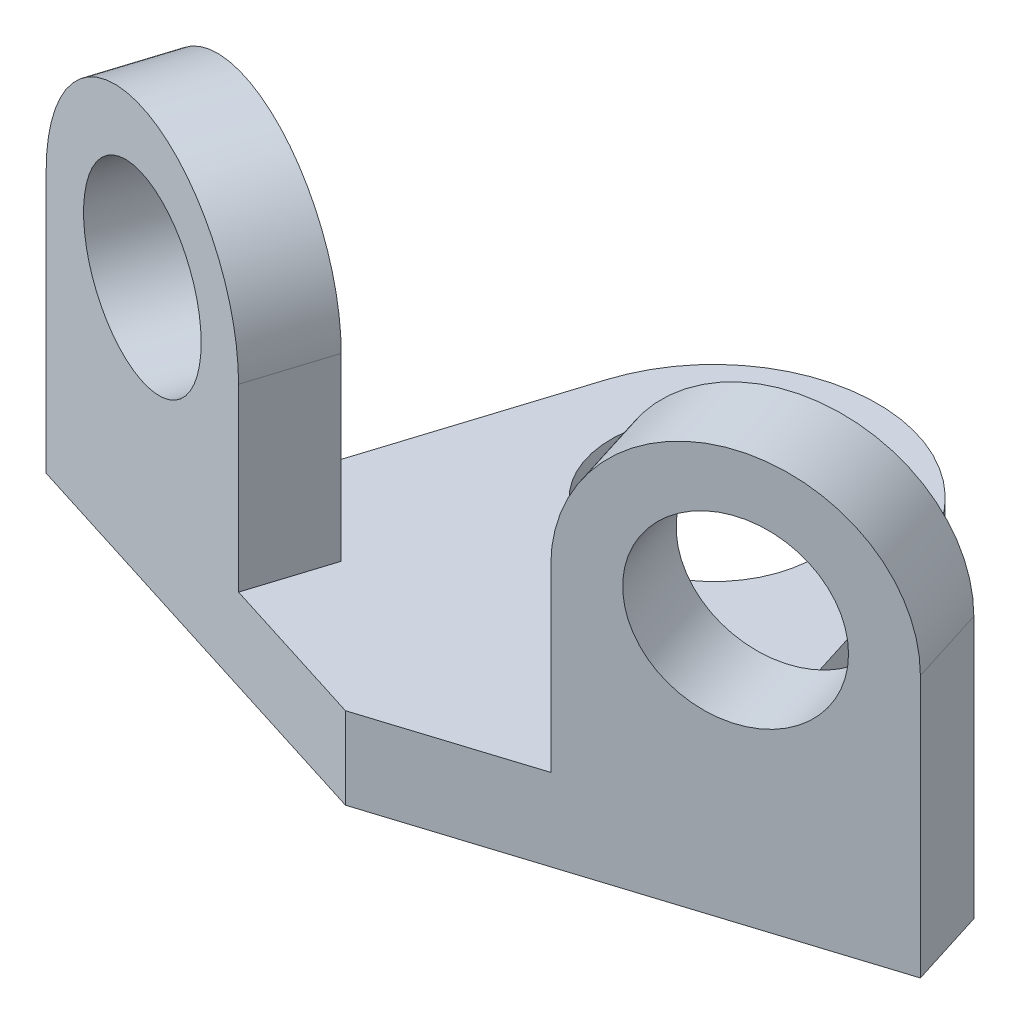
ISO-10303-21;
HEADER;
FILE_DESCRIPTION(('STEP AP214'),'2;1');
FILE_NAME('part.step','',(''),(''),'','','');
FILE_SCHEMA(('AUTOMOTIVE_DESIGN { 1 0 10303 214 1 1 1 1 }'));
ENDSEC;
DATA;
#1=APPLICATION_CONTEXT('core data for automotive mechanical design processes');
#2=APPLICATION_PROTOCOL_DEFINITION('international standard','automotive_design',2000,#1);
#3=PRODUCT_CONTEXT('',#1,'mechanical');
#4=PRODUCT('Part','Part','',(#3));
#5=PRODUCT_RELATED_PRODUCT_CATEGORY('part','',(#4));
#6=PRODUCT_DEFINITION_FORMATION('','',#4);
#7=PRODUCT_DEFINITION_CONTEXT('part definition',#1,'design');
#8=PRODUCT_DEFINITION('design','',#6,#7);
#9=PRODUCT_DEFINITION_SHAPE('','',#8);
#10=(LENGTH_UNIT() NAMED_UNIT(*) SI_UNIT(.MILLI.,.METRE.));
#11=(NAMED_UNIT(*) PLANE_ANGLE_UNIT() SI_UNIT($,.RADIAN.));
#12=(NAMED_UNIT(*) SI_UNIT($,.STERADIAN.) SOLID_ANGLE_UNIT());
#13=UNCERTAINTY_MEASURE_WITH_UNIT(LENGTH_MEASURE(1.E-05),#10,'distance_accuracy_value','');
#14=(GEOMETRIC_REPRESENTATION_CONTEXT(3) GLOBAL_UNCERTAINTY_ASSIGNED_CONTEXT((#13)) GLOBAL_UNIT_ASSIGNED_CONTEXT((#10,
#11,#12)) REPRESENTATION_CONTEXT('',''));
#15=CARTESIAN_POINT('',(0.,0.,0.));
#16=DIRECTION('',(0.,0.,1.));
#17=DIRECTION('',(1.,0.,0.));
#18=AXIS2_PLACEMENT_3D('',#15,#16,#17);
#19=CARTESIAN_POINT('',(0.,10.,0.));
#20=DIRECTION('',(0.,1.,0.));
#21=DIRECTION('',(0.,0.,1.));
#22=AXIS2_PLACEMENT_3D('',#19,#20,#21);
#23=PLANE('',#22);
#24=CARTESIAN_POINT('',(0.,10.,-45.));
#25=DIRECTION('',(0.,1.,0.));
#26=DIRECTION('',(0.,0.,1.));
#27=AXIS2_PLACEMENT_3D('',#24,#25,#26);
#28=CIRCLE('',#27,12.5);
#29=CARTESIAN_POINT('',(0.,10.,-32.5));
#30=VERTEX_POINT('',#29);
#31=EDGE_CURVE('E256',#30,#30,#28,.T.);
#32=ORIENTED_EDGE('',*,*,#31,.F.);
#33=EDGE_LOOP('',(#32));
#34=FACE_BOUND('',#33,.T.);
#35=DIRECTION('',(-0.953716950748227,0.,-0.300705799504273));
#36=VECTOR('',#35,1.);
#37=CARTESIAN_POINT('',(3.00705799504275,10.,-9.53716950748228));
#38=LINE('',#37,#36);
#39=CARTESIAN_POINT('',(-16.0672810199218,10.,-15.5512854975677));
#40=VERTEX_POINT('',#39);
#41=CARTESIAN_POINT('',(-28.9727508378203,10.,-19.6203645010654));
#42=VERTEX_POINT('',#41);
#43=EDGE_CURVE('E145',#40,#42,#38,.T.);
#44=ORIENTED_EDGE('',*,*,#43,.F.);
#45=DIRECTION('',(-0.300705799504274,0.,0.953716950748227));
#46=VECTOR('',#45,1.);
#47=CARTESIAN_POINT('',(0.11505008129907,10.,-66.8750827083204));
#48=LINE('',#47,#46);
#49=CARTESIAN_POINT('',(-19.0743390149645,10.,-6.01411599008547));
#50=VERTEX_POINT('',#49);
#51=EDGE_CURVE('E342',#40,#50,#48,.T.);
#52=ORIENTED_EDGE('',*,*,#51,.T.);
#53=DIRECTION('',(-0.953716950748227,0.,-0.300705799504274));
#54=VECTOR('',#53,1.);
#55=CARTESIAN_POINT('',(0.,10.,0.));
#56=LINE('',#55,#54);
#57=CARTESIAN_POINT('',(0.,10.,0.));
#58=VERTEX_POINT('',#57);
#59=EDGE_CURVE('E173',#58,#50,#56,.T.);
#60=ORIENTED_EDGE('',*,*,#59,.F.);
#61=DIRECTION('',(0.953716950748227,0.,-0.300705799504274));
#62=VECTOR('',#61,1.);
#63=CARTESIAN_POINT('',(0.,10.,0.));
#64=LINE('',#63,#62);
#65=CARTESIAN_POINT('',(19.0743390149645,10.,-6.01411599008547));
#66=VERTEX_POINT('',#65);
#67=EDGE_CURVE('E178',#58,#66,#64,.T.);
#68=ORIENTED_EDGE('',*,*,#67,.T.);
#69=DIRECTION('',(0.300705799504274,0.,0.953716950748227));
#70=VECTOR('',#69,1.);
#71=CARTESIAN_POINT('',(-0.115050081299091,10.,-66.8750827083204));
#72=LINE('',#71,#70);
#73=CARTESIAN_POINT('',(16.0672810199218,10.,-15.5512854975677));
#74=VERTEX_POINT('',#73);
#75=EDGE_CURVE('E72',#74,#66,#72,.T.);
#76=ORIENTED_EDGE('',*,*,#75,.F.);
#77=DIRECTION('',(-0.953716950748227,0.,0.300705799504274));
#78=VECTOR('',#77,1.);
#79=CARTESIAN_POINT('',(16.0672810199218,10.,-15.5512854975677));
#80=LINE('',#79,#78);
#81=CARTESIAN_POINT('',(28.9727508378203,10.,-19.6203645010654));
#82=VERTEX_POINT('',#81);
#83=EDGE_CURVE('E12',#82,#74,#80,.T.);
#84=ORIENTED_EDGE('',*,*,#83,.F.);
#85=DIRECTION('',(-0.300705799504273,0.,-0.953716950748227));
#86=VECTOR('',#85,1.);
#87=CARTESIAN_POINT('',(31.9798088328631,10.,-10.0831949935831));
#88=LINE('',#87,#86);
#89=CARTESIAN_POINT('',(19.0743390149645,10.,-51.0141159900855));
#90=VERTEX_POINT('',#89);
#91=EDGE_CURVE('E180',#82,#90,#88,.T.);
#92=ORIENTED_EDGE('',*,*,#91,.T.);
#93=CARTESIAN_POINT('',(0.,10.,-45.));
#94=DIRECTION('',(0.,1.,0.));
#95=DIRECTION('',(0.,0.,1.));
#96=AXIS2_PLACEMENT_3D('',#93,#94,#95);
#97=CIRCLE('',#96,20.);
#98=CARTESIAN_POINT('',(-19.0743390149645,10.,-51.0141159900855));
#99=VERTEX_POINT('',#98);
#100=EDGE_CURVE('E133',#90,#99,#97,.T.);
#101=ORIENTED_EDGE('',*,*,#100,.T.);
#102=DIRECTION('',(0.300705799504273,0.,-0.953716950748227));
#103=VECTOR('',#102,1.);
#104=CARTESIAN_POINT('',(-31.9798088328631,10.,-10.0831949935831));
#105=LINE('',#104,#103);
#106=EDGE_CURVE('E164',#42,#99,#105,.T.);
#107=ORIENTED_EDGE('',*,*,#106,.F.);
#108=EDGE_LOOP('',(#44,#52,#60,#68,#76,#84,#92,#101,#107));
#109=FACE_BOUND('',#108,.T.);
#110=ADVANCED_FACE('F51',(#34,#109),#23,.T.);
#111=CARTESIAN_POINT('',(31.9798088328631,10.,-10.0831949935831));
#112=DIRECTION('',(-0.953716950748227,0.,0.300705799504273));
#113=DIRECTION('',(0.300705799504273,0.,0.953716950748227));
#114=AXIS2_PLACEMENT_3D('',#111,#112,#113);
#115=PLANE('',#114);
#116=DIRECTION('',(-0.300705799504273,0.,-0.953716950748227));
#117=VECTOR('',#116,1.);
#118=CARTESIAN_POINT('',(31.9798088328631,0.,-10.0831949935831));
#119=LINE('',#118,#117);
#120=CARTESIAN_POINT('',(28.9727508378203,0.,-19.6203645010654));
#121=VERTEX_POINT('',#120);
#122=CARTESIAN_POINT('',(19.0743390149645,0.,-51.0141159900855));
#123=VERTEX_POINT('',#122);
#124=EDGE_CURVE('E201',#121,#123,#119,.T.);
#125=ORIENTED_EDGE('',*,*,#124,.T.);
#126=DIRECTION('',(0.,-1.,0.));
#127=VECTOR('',#126,1.);
#128=CARTESIAN_POINT('',(19.0743390149645,10.,-51.0141159900855));
#129=LINE('',#128,#127);
#130=EDGE_CURVE('E55',#90,#123,#129,.T.);
#131=ORIENTED_EDGE('',*,*,#130,.F.);
#132=ORIENTED_EDGE('',*,*,#91,.F.);
#133=DIRECTION('',(0.,-1.,0.));
#134=VECTOR('',#133,1.);
#135=CARTESIAN_POINT('',(28.9727508378203,10.,-19.6203645010654));
#136=LINE('',#135,#134);
#137=EDGE_CURVE('E228',#82,#121,#136,.T.);
#138=ORIENTED_EDGE('',*,*,#137,.T.);
#139=EDGE_LOOP('',(#125,#131,#132,#138));
#140=FACE_BOUND('',#139,.T.);
#141=ADVANCED_FACE('F227',(#140),#115,.F.);
#142=CARTESIAN_POINT('',(0.,10.,-45.));
#143=DIRECTION('',(0.,-1.,0.));
#144=DIRECTION('',(0.,0.,-1.));
#145=AXIS2_PLACEMENT_3D('',#142,#143,#144);
#146=CYLINDRICAL_SURFACE('',#145,20.);
#147=CARTESIAN_POINT('',(0.,0.,-45.));
#148=DIRECTION('',(0.,1.,0.));
#149=DIRECTION('',(0.,0.,1.));
#150=AXIS2_PLACEMENT_3D('',#147,#148,#149);
#151=CIRCLE('',#150,20.);
#152=CARTESIAN_POINT('',(-19.0743390149645,0.,-51.0141159900855));
#153=VERTEX_POINT('',#152);
#154=EDGE_CURVE('E195',#123,#153,#151,.T.);
#155=ORIENTED_EDGE('',*,*,#154,.T.);
#156=DIRECTION('',(0.,-1.,0.));
#157=VECTOR('',#156,1.);
#158=CARTESIAN_POINT('',(-19.0743390149645,10.,-51.0141159900855));
#159=LINE('',#158,#157);
#160=EDGE_CURVE('E169',#99,#153,#159,.T.);
#161=ORIENTED_EDGE('',*,*,#160,.F.);
#162=ORIENTED_EDGE('',*,*,#100,.F.);
#163=ORIENTED_EDGE('',*,*,#130,.T.);
#164=EDGE_LOOP('',(#155,#161,#162,#163));
#165=FACE_BOUND('',#164,.T.);
#166=ADVANCED_FACE('F223',(#165),#146,.T.);
#167=CARTESIAN_POINT('',(-31.9798088328631,10.,-10.0831949935831));
#168=DIRECTION('',(-0.953716950748227,0.,-0.300705799504273));
#169=DIRECTION('',(-0.300705799504273,0.,0.953716950748227));
#170=AXIS2_PLACEMENT_3D('',#167,#168,#169);
#171=PLANE('',#170);
#172=DIRECTION('',(0.300705799504273,0.,-0.953716950748227));
#173=VECTOR('',#172,1.);
#174=CARTESIAN_POINT('',(-31.9798088328631,0.,-10.0831949935831));
#175=LINE('',#174,#173);
#176=CARTESIAN_POINT('',(-28.9727508378203,0.,-19.6203645010654));
#177=VERTEX_POINT('',#176);
#178=EDGE_CURVE('E166',#177,#153,#175,.T.);
#179=ORIENTED_EDGE('',*,*,#178,.F.);
#180=DIRECTION('',(0.,-1.,0.));
#181=VECTOR('',#180,1.);
#182=CARTESIAN_POINT('',(-28.9727508378203,10.,-19.6203645010654));
#183=LINE('',#182,#181);
#184=EDGE_CURVE('E150',#42,#177,#183,.T.);
#185=ORIENTED_EDGE('',*,*,#184,.F.);
#186=ORIENTED_EDGE('',*,*,#106,.T.);
#187=ORIENTED_EDGE('',*,*,#160,.T.);
#188=EDGE_LOOP('',(#179,#185,#186,#187));
#189=FACE_BOUND('',#188,.T.);
#190=ADVANCED_FACE('F163',(#189),#171,.T.);
#191=CARTESIAN_POINT('',(3.00705799504274,10.,-9.53716950748228));
#192=DIRECTION('',(0.300705799504273,0.,-0.953716950748227));
#193=DIRECTION('',(-0.953716950748227,0.,-0.300705799504273));
#194=AXIS2_PLACEMENT_3D('',#191,#192,#193);
#195=PLANE('',#194);
#196=DIRECTION('',(0.953716950748227,0.,0.300705799504273));
#197=VECTOR('',#196,1.);
#198=CARTESIAN_POINT('',(3.00705799504274,0.,-9.53716950748228));
#199=LINE('',#198,#197);
#200=CARTESIAN_POINT('',(-50.401091246858,0.,-26.3766942797216));
#201=VERTEX_POINT('',#200);
#202=EDGE_CURVE('E207',#201,#177,#199,.T.);
#203=ORIENTED_EDGE('',*,*,#202,.F.);
#204=DIRECTION('',(0.,-1.,0.));
#205=VECTOR('',#204,1.);
#206=CARTESIAN_POINT('',(-50.401091246858,10.,-26.3766942797216));
#207=LINE('',#206,#205);
#208=CARTESIAN_POINT('',(-50.401091246858,32.,-26.3766942797216));
#209=VERTEX_POINT('',#208);
#210=EDGE_CURVE('E170',#209,#201,#207,.T.);
#211=ORIENTED_EDGE('',*,*,#210,.F.);
#212=CARTESIAN_POINT('',(-33.2341861333899,32.,-20.9639898886447));
#213=DIRECTION('',(0.300705799504273,0.,-0.953716950748227));
#214=DIRECTION('',(-0.953716950748227,0.,-0.300705799504273));
#215=AXIS2_PLACEMENT_3D('',#212,#213,#214);
#216=CIRCLE('',#215,18.);
#217=CARTESIAN_POINT('',(-16.0672810199218,32.,-15.5512854975677));
#218=VERTEX_POINT('',#217);
#219=EDGE_CURVE('E348',#218,#209,#216,.F.);
#220=ORIENTED_EDGE('',*,*,#219,.F.);
#221=DIRECTION('',(0.,-1.,0.));
#222=VECTOR('',#221,1.);
#223=CARTESIAN_POINT('',(-16.0672810199218,0.,-15.5512854975677));
#224=LINE('',#223,#222);
#225=EDGE_CURVE('E155',#218,#40,#224,.T.);
#226=ORIENTED_EDGE('',*,*,#225,.T.);
#227=ORIENTED_EDGE('',*,*,#43,.T.);
#228=ORIENTED_EDGE('',*,*,#184,.T.);
#229=EDGE_LOOP('',(#203,#211,#220,#226,#227,#228));
#230=FACE_BOUND('',#229,.T.);
#231=CARTESIAN_POINT('',(-33.2341861333899,32.,-20.9639898886447));
#232=DIRECTION('',(0.300705799504273,0.,-0.953716950748227));
#233=DIRECTION('',(-0.953716950748227,0.,-0.300705799504273));
#234=AXIS2_PLACEMENT_3D('',#231,#232,#233);
#235=CIRCLE('',#234,11.);
#236=CARTESIAN_POINT('',(-43.7250725916204,32.,-24.2717536831917));
#237=VERTEX_POINT('',#236);
#238=EDGE_CURVE('E275',#237,#237,#235,.F.);
#239=ORIENTED_EDGE('',*,*,#238,.T.);
#240=EDGE_LOOP('',(#239));
#241=FACE_BOUND('',#240,.T.);
#242=ADVANCED_FACE('F148',(#230,#241),#195,.T.);
#243=CARTESIAN_POINT('',(-53.4081492419007,10.,-16.8395247722393));
#244=DIRECTION('',(-0.953716950748227,0.,-0.300705799504274));
#245=DIRECTION('',(-0.300705799504274,0.,0.953716950748227));
#246=AXIS2_PLACEMENT_3D('',#243,#244,#245);
#247=PLANE('',#246);
#248=DIRECTION('',(0.300705799504274,0.,-0.953716950748227));
#249=VECTOR('',#248,1.);
#250=CARTESIAN_POINT('',(-53.4081492419007,0.,-16.8395247722393));
#251=LINE('',#250,#249);
#252=CARTESIAN_POINT('',(-53.4081492419007,0.,-16.8395247722393));
#253=VERTEX_POINT('',#252);
#254=EDGE_CURVE('E281',#253,#201,#251,.T.);
#255=ORIENTED_EDGE('',*,*,#254,.F.);
#256=DIRECTION('',(0.,-1.,0.));
#257=VECTOR('',#256,1.);
#258=CARTESIAN_POINT('',(-53.4081492419007,10.,-16.8395247722393));
#259=LINE('',#258,#257);
#260=CARTESIAN_POINT('',(-53.4081492419007,32.,-16.8395247722393));
#261=VERTEX_POINT('',#260);
#262=EDGE_CURVE('E305',#261,#253,#259,.T.);
#263=ORIENTED_EDGE('',*,*,#262,.F.);
#264=DIRECTION('',(-0.300705799504274,0.,0.953716950748227));
#265=VECTOR('',#264,1.);
#266=CARTESIAN_POINT('',(-34.2187601456371,32.,-77.7004914904742));
#267=LINE('',#266,#265);
#268=EDGE_CURVE('E322',#209,#261,#267,.T.);
#269=ORIENTED_EDGE('',*,*,#268,.F.);
#270=ORIENTED_EDGE('',*,*,#210,.T.);
#271=EDGE_LOOP('',(#255,#263,#269,#270));
#272=FACE_BOUND('',#271,.T.);
#273=ADVANCED_FACE('F319',(#272),#247,.T.);
#274=CARTESIAN_POINT('',(0.,10.,0.));
#275=DIRECTION('',(-0.300705799504274,0.,0.953716950748227));
#276=DIRECTION('',(0.953716950748227,0.,0.300705799504274));
#277=AXIS2_PLACEMENT_3D('',#274,#275,#276);
#278=PLANE('',#277);
#279=DIRECTION('',(-0.953716950748227,0.,-0.300705799504274));
#280=VECTOR('',#279,1.);
#281=CARTESIAN_POINT('',(0.,0.,0.));
#282=LINE('',#281,#280);
#283=CARTESIAN_POINT('',(0.,0.,0.));
#284=VERTEX_POINT('',#283);
#285=EDGE_CURVE('E286',#284,#253,#282,.T.);
#286=ORIENTED_EDGE('',*,*,#285,.F.);
#287=DIRECTION('',(0.,-1.,0.));
#288=VECTOR('',#287,1.);
#289=CARTESIAN_POINT('',(0.,10.,0.));
#290=LINE('',#289,#288);
#291=EDGE_CURVE('E301',#58,#284,#290,.T.);
#292=ORIENTED_EDGE('',*,*,#291,.F.);
#293=ORIENTED_EDGE('',*,*,#59,.T.);
#294=DIRECTION('',(0.,-1.,0.));
#295=VECTOR('',#294,1.);
#296=CARTESIAN_POINT('',(-19.0743390149645,0.,-6.01411599008547));
#297=LINE('',#296,#295);
#298=CARTESIAN_POINT('',(-19.0743390149645,32.,-6.01411599008547));
#299=VERTEX_POINT('',#298);
#300=EDGE_CURVE('E416',#299,#50,#297,.T.);
#301=ORIENTED_EDGE('',*,*,#300,.F.);
#302=CARTESIAN_POINT('',(-36.2412441284326,32.,-11.4268203811624));
#303=DIRECTION('',(-0.300705799504274,0.,0.953716950748227));
#304=DIRECTION('',(0.953716950748227,0.,0.300705799504274));
#305=AXIS2_PLACEMENT_3D('',#302,#303,#304);
#306=CIRCLE('',#305,18.);
#307=EDGE_CURVE('E355',#299,#261,#306,.T.);
#308=ORIENTED_EDGE('',*,*,#307,.T.);
#309=ORIENTED_EDGE('',*,*,#262,.T.);
#310=EDGE_LOOP('',(#286,#292,#293,#301,#308,#309));
#311=FACE_BOUND('',#310,.T.);
#312=CARTESIAN_POINT('',(-36.2412441284326,32.,-11.4268203811624));
#313=DIRECTION('',(-0.300705799504274,0.,0.953716950748227));
#314=DIRECTION('',(0.953716950748227,0.,0.300705799504274));
#315=AXIS2_PLACEMENT_3D('',#312,#313,#314);
#316=CIRCLE('',#315,11.);
#317=CARTESIAN_POINT('',(-25.7503576702021,32.,-8.11905658661539));
#318=VERTEX_POINT('',#317);
#319=EDGE_CURVE('E274',#318,#318,#316,.T.);
#320=ORIENTED_EDGE('',*,*,#319,.F.);
#321=EDGE_LOOP('',(#320));
#322=FACE_BOUND('',#321,.T.);
#323=ADVANCED_FACE('F328',(#311,#322),#278,.T.);
#324=CARTESIAN_POINT('',(0.,10.,0.));
#325=DIRECTION('',(-0.300705799504274,0.,-0.953716950748227));
#326=DIRECTION('',(-0.953716950748227,0.,0.300705799504274));
#327=AXIS2_PLACEMENT_3D('',#324,#325,#326);
#328=PLANE('',#327);
#329=DIRECTION('',(0.953716950748227,0.,-0.300705799504274));
#330=VECTOR('',#329,1.);
#331=CARTESIAN_POINT('',(0.,0.,0.));
#332=LINE('',#331,#330);
#333=CARTESIAN_POINT('',(53.4081492419007,0.,-16.8395247722393));
#334=VERTEX_POINT('',#333);
#335=EDGE_CURVE('E291',#284,#334,#332,.T.);
#336=ORIENTED_EDGE('',*,*,#335,.T.);
#337=DIRECTION('',(0.,-1.,0.));
#338=VECTOR('',#337,1.);
#339=CARTESIAN_POINT('',(53.4081492419007,10.,-16.8395247722393));
#340=LINE('',#339,#338);
#341=CARTESIAN_POINT('',(53.4081492419007,32.,-16.8395247722393));
#342=VERTEX_POINT('',#341);
#343=EDGE_CURVE('E306',#342,#334,#340,.T.);
#344=ORIENTED_EDGE('',*,*,#343,.F.);
#345=CARTESIAN_POINT('',(36.2412441284326,32.,-11.4268203811624));
#346=DIRECTION('',(0.300705799504274,0.,0.953716950748227));
#347=DIRECTION('',(0.953716950748227,0.,-0.300705799504274));
#348=AXIS2_PLACEMENT_3D('',#345,#346,#347);
#349=CIRCLE('',#348,18.);
#350=CARTESIAN_POINT('',(19.0743390149645,32.,-6.01411599008548));
#351=VERTEX_POINT('',#350);
#352=EDGE_CURVE('E406',#342,#351,#349,.T.);
#353=ORIENTED_EDGE('',*,*,#352,.T.);
#354=DIRECTION('',(0.,-1.,0.));
#355=VECTOR('',#354,1.);
#356=CARTESIAN_POINT('',(19.0743390149645,32.,-6.01411599008548));
#357=LINE('',#356,#355);
#358=EDGE_CURVE('E253',#351,#66,#357,.T.);
#359=ORIENTED_EDGE('',*,*,#358,.T.);
#360=ORIENTED_EDGE('',*,*,#67,.F.);
#361=ORIENTED_EDGE('',*,*,#291,.T.);
#362=EDGE_LOOP('',(#336,#344,#353,#359,#360,#361));
#363=FACE_BOUND('',#362,.T.);
#364=CARTESIAN_POINT('',(36.2412441284326,32.,-11.4268203811624));
#365=DIRECTION('',(0.300705799504274,0.,0.953716950748227));
#366=DIRECTION('',(0.953716950748227,0.,-0.300705799504274));
#367=AXIS2_PLACEMENT_3D('',#364,#365,#366);
#368=CIRCLE('',#367,11.);
#369=CARTESIAN_POINT('',(46.7321305866631,32.,-14.7345841757094));
#370=VERTEX_POINT('',#369);
#371=EDGE_CURVE('E401',#370,#370,#368,.T.);
#372=ORIENTED_EDGE('',*,*,#371,.F.);
#373=EDGE_LOOP('',(#372));
#374=FACE_BOUND('',#373,.T.);
#375=ADVANCED_FACE('F336',(#363,#374),#328,.F.);
#376=CARTESIAN_POINT('',(53.4081492419007,10.,-16.8395247722393));
#377=DIRECTION('',(-0.953716950748227,0.,0.300705799504274));
#378=DIRECTION('',(0.300705799504274,0.,0.953716950748227));
#379=AXIS2_PLACEMENT_3D('',#376,#377,#378);
#380=PLANE('',#379);
#381=DIRECTION('',(-0.300705799504274,0.,-0.953716950748227));
#382=VECTOR('',#381,1.);
#383=CARTESIAN_POINT('',(53.4081492419007,0.,-16.8395247722393));
#384=LINE('',#383,#382);
#385=CARTESIAN_POINT('',(50.401091246858,0.,-26.3766942797216));
#386=VERTEX_POINT('',#385);
#387=EDGE_CURVE('E387',#334,#386,#384,.T.);
#388=ORIENTED_EDGE('',*,*,#387,.T.);
#389=DIRECTION('',(0.,-1.,0.));
#390=VECTOR('',#389,1.);
#391=CARTESIAN_POINT('',(50.401091246858,10.,-26.3766942797216));
#392=LINE('',#391,#390);
#393=CARTESIAN_POINT('',(50.401091246858,32.,-26.3766942797216));
#394=VERTEX_POINT('',#393);
#395=EDGE_CURVE('E375',#394,#386,#392,.T.);
#396=ORIENTED_EDGE('',*,*,#395,.F.);
#397=DIRECTION('',(0.300705799504274,0.,0.953716950748227));
#398=VECTOR('',#397,1.);
#399=CARTESIAN_POINT('',(34.2187601456371,32.,-77.7004914904742));
#400=LINE('',#399,#398);
#401=EDGE_CURVE('E390',#394,#342,#400,.T.);
#402=ORIENTED_EDGE('',*,*,#401,.T.);
#403=ORIENTED_EDGE('',*,*,#343,.T.);
#404=EDGE_LOOP('',(#388,#396,#402,#403));
#405=FACE_BOUND('',#404,.T.);
#406=ADVANCED_FACE('F386',(#405),#380,.F.);
#407=CARTESIAN_POINT('',(0.,10.,-45.));
#408=DIRECTION('',(0.,-1.,0.));
#409=DIRECTION('',(0.,0.,-1.));
#410=AXIS2_PLACEMENT_3D('',#407,#408,#409);
#411=CYLINDRICAL_SURFACE('',#410,12.5);
#412=ORIENTED_EDGE('',*,*,#31,.T.);
#413=EDGE_LOOP('',(#412));
#414=FACE_BOUND('',#413,.T.);
#415=CARTESIAN_POINT('',(0.,0.,-45.));
#416=DIRECTION('',(0.,1.,0.));
#417=DIRECTION('',(0.,0.,1.));
#418=AXIS2_PLACEMENT_3D('',#415,#416,#417);
#419=CIRCLE('',#418,12.5);
#420=CARTESIAN_POINT('',(0.,0.,-32.5));
#421=VERTEX_POINT('',#420);
#422=EDGE_CURVE('E231',#421,#421,#419,.T.);
#423=ORIENTED_EDGE('',*,*,#422,.F.);
#424=EDGE_LOOP('',(#423));
#425=FACE_BOUND('',#424,.T.);
#426=ADVANCED_FACE('F53',(#414,#425),#411,.F.);
#427=CARTESIAN_POINT('',(-3.00705799504274,10.,-9.53716950748228));
#428=DIRECTION('',(0.300705799504274,0.,0.953716950748227));
#429=DIRECTION('',(0.953716950748227,0.,-0.300705799504274));
#430=AXIS2_PLACEMENT_3D('',#427,#428,#429);
#431=PLANE('',#430);
#432=DIRECTION('',(-0.953716950748227,0.,0.300705799504274));
#433=VECTOR('',#432,1.);
#434=CARTESIAN_POINT('',(-3.00705799504274,0.,-9.53716950748228));
#435=LINE('',#434,#433);
#436=EDGE_CURVE('E124',#386,#121,#435,.T.);
#437=ORIENTED_EDGE('',*,*,#436,.T.);
#438=ORIENTED_EDGE('',*,*,#137,.F.);
#439=ORIENTED_EDGE('',*,*,#83,.T.);
#440=DIRECTION('',(0.,1.,0.));
#441=VECTOR('',#440,1.);
#442=CARTESIAN_POINT('',(16.0672810199218,32.,-15.5512854975678));
#443=LINE('',#442,#441);
#444=CARTESIAN_POINT('',(16.0672810199218,32.,-15.5512854975678));
#445=VERTEX_POINT('',#444);
#446=EDGE_CURVE('E239',#74,#445,#443,.T.);
#447=ORIENTED_EDGE('',*,*,#446,.T.);
#448=CARTESIAN_POINT('',(33.2341861333899,32.,-20.9639898886447));
#449=DIRECTION('',(0.300705799504274,0.,0.953716950748227));
#450=DIRECTION('',(0.953716950748227,0.,-0.300705799504274));
#451=AXIS2_PLACEMENT_3D('',#448,#449,#450);
#452=CIRCLE('',#451,18.);
#453=EDGE_CURVE('E365',#445,#394,#452,.F.);
#454=ORIENTED_EDGE('',*,*,#453,.T.);
#455=ORIENTED_EDGE('',*,*,#395,.T.);
#456=EDGE_LOOP('',(#437,#438,#439,#447,#454,#455));
#457=FACE_BOUND('',#456,.T.);
#458=CARTESIAN_POINT('',(33.2341861333899,32.,-20.9639898886447));
#459=DIRECTION('',(0.300705799504274,0.,0.953716950748227));
#460=DIRECTION('',(0.953716950748227,0.,-0.300705799504274));
#461=AXIS2_PLACEMENT_3D('',#458,#459,#460);
#462=CIRCLE('',#461,11.);
#463=CARTESIAN_POINT('',(43.7250725916204,32.,-24.2717536831917));
#464=VERTEX_POINT('',#463);
#465=EDGE_CURVE('E234',#464,#464,#462,.F.);
#466=ORIENTED_EDGE('',*,*,#465,.F.);
#467=EDGE_LOOP('',(#466));
#468=FACE_BOUND('',#467,.T.);
#469=ADVANCED_FACE('F444',(#457,#468),#431,.F.);
#470=CARTESIAN_POINT('',(0.,0.,0.));
#471=DIRECTION('',(0.,1.,0.));
#472=DIRECTION('',(0.,0.,1.));
#473=AXIS2_PLACEMENT_3D('',#470,#471,#472);
#474=PLANE('',#473);
#475=ORIENTED_EDGE('',*,*,#422,.T.);
#476=EDGE_LOOP('',(#475));
#477=FACE_BOUND('',#476,.T.);
#478=ORIENTED_EDGE('',*,*,#124,.F.);
#479=ORIENTED_EDGE('',*,*,#436,.F.);
#480=ORIENTED_EDGE('',*,*,#387,.F.);
#481=ORIENTED_EDGE('',*,*,#335,.F.);
#482=ORIENTED_EDGE('',*,*,#285,.T.);
#483=ORIENTED_EDGE('',*,*,#254,.T.);
#484=ORIENTED_EDGE('',*,*,#202,.T.);
#485=ORIENTED_EDGE('',*,*,#178,.T.);
#486=ORIENTED_EDGE('',*,*,#154,.F.);
#487=EDGE_LOOP('',(#478,#479,#480,#481,#482,#483,#484,#485,#486));
#488=FACE_BOUND('',#487,.T.);
#489=ADVANCED_FACE('F325',(#477,#488),#474,.F.);
#490=CARTESIAN_POINT('',(-0.115050081299084,32.,-66.8750827083204));
#491=DIRECTION('',(-0.953716950748227,0.,0.300705799504274));
#492=DIRECTION('',(0.300705799504274,0.,0.953716950748227));
#493=AXIS2_PLACEMENT_3D('',#490,#491,#492);
#494=PLANE('',#493);
#495=ORIENTED_EDGE('',*,*,#446,.F.);
#496=ORIENTED_EDGE('',*,*,#75,.T.);
#497=ORIENTED_EDGE('',*,*,#358,.F.);
#498=DIRECTION('',(0.300705799504274,0.,0.953716950748227));
#499=VECTOR('',#498,1.);
#500=CARTESIAN_POINT('',(-0.115050081299084,32.,-66.8750827083204));
#501=LINE('',#500,#499);
#502=EDGE_CURVE('E248',#445,#351,#501,.T.);
#503=ORIENTED_EDGE('',*,*,#502,.F.);
#504=EDGE_LOOP('',(#495,#496,#497,#503));
#505=FACE_BOUND('',#504,.T.);
#506=ADVANCED_FACE('F451',(#505),#494,.T.);
#507=CARTESIAN_POINT('',(17.051855032169,32.,-72.2877870993973));
#508=DIRECTION('',(0.300705799504274,0.,0.953716950748227));
#509=DIRECTION('',(0.953716950748227,0.,-0.300705799504274));
#510=AXIS2_PLACEMENT_3D('',#507,#508,#509);
#511=CYLINDRICAL_SURFACE('',#510,18.);
#512=ORIENTED_EDGE('',*,*,#453,.F.);
#513=ORIENTED_EDGE('',*,*,#502,.T.);
#514=ORIENTED_EDGE('',*,*,#352,.F.);
#515=ORIENTED_EDGE('',*,*,#401,.F.);
#516=EDGE_LOOP('',(#512,#513,#514,#515));
#517=FACE_BOUND('',#516,.T.);
#518=ADVANCED_FACE('F449',(#517),#511,.T.);
#519=CARTESIAN_POINT('',(17.051855032169,32.,-72.2877870993973));
#520=DIRECTION('',(0.300705799504274,0.,0.953716950748227));
#521=DIRECTION('',(0.953716950748227,0.,-0.300705799504274));
#522=AXIS2_PLACEMENT_3D('',#519,#520,#521);
#523=CYLINDRICAL_SURFACE('',#522,11.);
#524=ORIENTED_EDGE('',*,*,#465,.T.);
#525=EDGE_LOOP('',(#524));
#526=FACE_BOUND('',#525,.T.);
#527=ORIENTED_EDGE('',*,*,#371,.T.);
#528=EDGE_LOOP('',(#527));
#529=FACE_BOUND('',#528,.T.);
#530=ADVANCED_FACE('F460',(#526,#529),#523,.F.);
#531=CARTESIAN_POINT('',(-17.051855032169,32.,-72.2877870993973));
#532=DIRECTION('',(-0.300705799504274,0.,0.953716950748227));
#533=DIRECTION('',(0.953716950748227,0.,0.300705799504274));
#534=AXIS2_PLACEMENT_3D('',#531,#532,#533);
#535=CYLINDRICAL_SURFACE('',#534,11.);
#536=ORIENTED_EDGE('',*,*,#319,.T.);
#537=EDGE_LOOP('',(#536));
#538=FACE_BOUND('',#537,.T.);
#539=ORIENTED_EDGE('',*,*,#238,.F.);
#540=EDGE_LOOP('',(#539));
#541=FACE_BOUND('',#540,.T.);
#542=ADVANCED_FACE('F458',(#538,#541),#535,.F.);
#543=CARTESIAN_POINT('',(-17.051855032169,32.,-72.2877870993973));
#544=DIRECTION('',(-0.300705799504274,0.,0.953716950748227));
#545=DIRECTION('',(0.953716950748227,0.,0.300705799504274));
#546=AXIS2_PLACEMENT_3D('',#543,#544,#545);
#547=CYLINDRICAL_SURFACE('',#546,18.);
#548=DIRECTION('',(-0.300705799504274,0.,0.953716950748227));
#549=VECTOR('',#548,1.);
#550=CARTESIAN_POINT('',(0.115050081299074,32.,-66.8750827083204));
#551=LINE('',#550,#549);
#552=EDGE_CURVE('E352',#218,#299,#551,.T.);
#553=ORIENTED_EDGE('',*,*,#552,.F.);
#554=ORIENTED_EDGE('',*,*,#219,.T.);
#555=ORIENTED_EDGE('',*,*,#268,.T.);
#556=ORIENTED_EDGE('',*,*,#307,.F.);
#557=EDGE_LOOP('',(#553,#554,#555,#556));
#558=FACE_BOUND('',#557,.T.);
#559=ADVANCED_FACE('F426',(#558),#547,.T.);
#560=CARTESIAN_POINT('',(0.115050081299081,0.,-66.8750827083204));
#561=DIRECTION('',(-0.953716950748227,0.,-0.300705799504274));
#562=DIRECTION('',(-0.300705799504274,0.,0.953716950748227));
#563=AXIS2_PLACEMENT_3D('',#560,#561,#562);
#564=PLANE('',#563);
#565=ORIENTED_EDGE('',*,*,#225,.F.);
#566=ORIENTED_EDGE('',*,*,#552,.T.);
#567=ORIENTED_EDGE('',*,*,#300,.T.);
#568=ORIENTED_EDGE('',*,*,#51,.F.);
#569=EDGE_LOOP('',(#565,#566,#567,#568));
#570=FACE_BOUND('',#569,.T.);
#571=ADVANCED_FACE('F467',(#570),#564,.F.);
#572=CLOSED_SHELL('',(#110,#141,#166,#190,#242,#273,#323,#375,#406,#426,#469,#489,#506,#518,
#530,#542,#559,#571));
#573=MANIFOLD_SOLID_BREP('B2',#572);
#574=ADVANCED_BREP_SHAPE_REPRESENTATION('',(#18,#573),#14);
#575=SHAPE_DEFINITION_REPRESENTATION(#9,#574);
ENDSEC;
END-ISO-10303-21;
